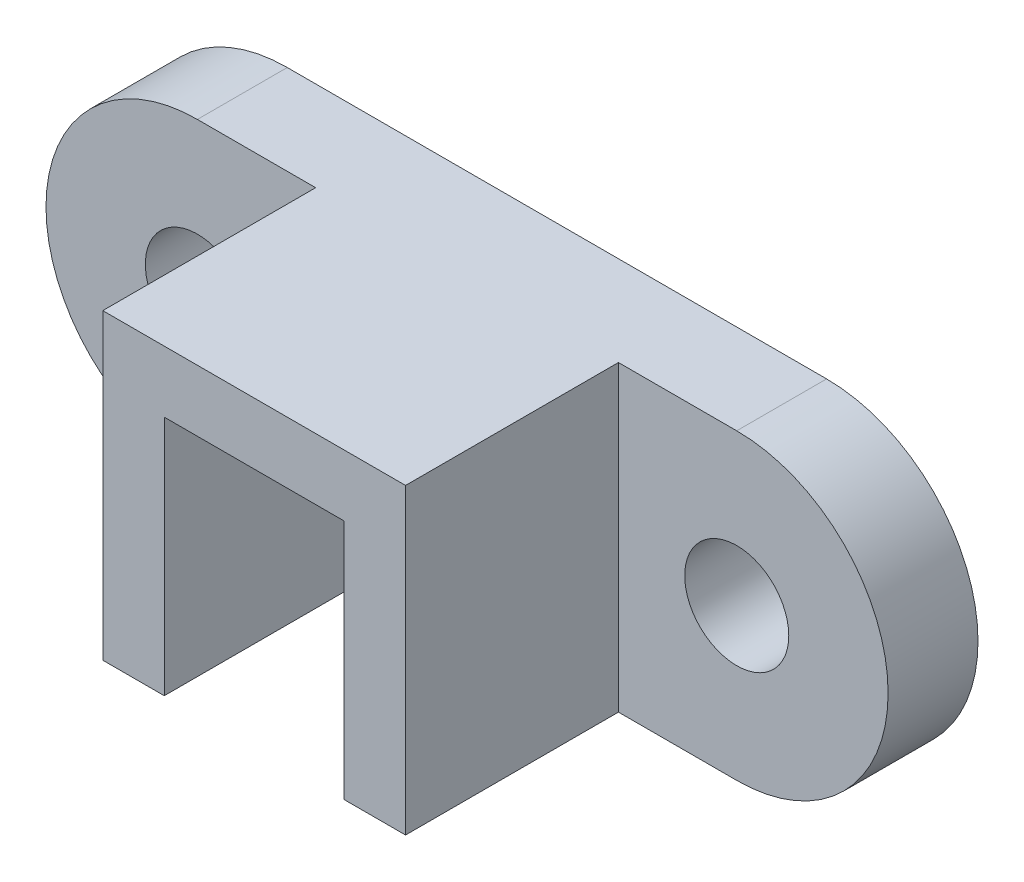
ISO-10303-21;
HEADER;
FILE_DESCRIPTION(('STEP AP214'),'2;1');
FILE_NAME('part.step','',(''),(''),'','','');
FILE_SCHEMA(('AUTOMOTIVE_DESIGN { 1 0 10303 214 1 1 1 1 }'));
ENDSEC;
DATA;
#1=APPLICATION_CONTEXT('core data for automotive mechanical design processes');
#2=APPLICATION_PROTOCOL_DEFINITION('international standard','automotive_design',2000,#1);
#3=PRODUCT_CONTEXT('',#1,'mechanical');
#4=PRODUCT('Part','Part','',(#3));
#5=PRODUCT_RELATED_PRODUCT_CATEGORY('part','',(#4));
#6=PRODUCT_DEFINITION_FORMATION('','',#4);
#7=PRODUCT_DEFINITION_CONTEXT('part definition',#1,'design');
#8=PRODUCT_DEFINITION('design','',#6,#7);
#9=PRODUCT_DEFINITION_SHAPE('','',#8);
#10=(LENGTH_UNIT() NAMED_UNIT(*) SI_UNIT(.MILLI.,.METRE.));
#11=(NAMED_UNIT(*) PLANE_ANGLE_UNIT() SI_UNIT($,.RADIAN.));
#12=(NAMED_UNIT(*) SI_UNIT($,.STERADIAN.) SOLID_ANGLE_UNIT());
#13=UNCERTAINTY_MEASURE_WITH_UNIT(LENGTH_MEASURE(1.E-05),#10,'distance_accuracy_value','');
#14=(GEOMETRIC_REPRESENTATION_CONTEXT(3) GLOBAL_UNCERTAINTY_ASSIGNED_CONTEXT((#13)) GLOBAL_UNIT_ASSIGNED_CONTEXT((#10,
#11,#12)) REPRESENTATION_CONTEXT('',''));
#15=CARTESIAN_POINT('',(0.,0.,0.));
#16=DIRECTION('',(0.,0.,1.));
#17=DIRECTION('',(1.,0.,0.));
#18=AXIS2_PLACEMENT_3D('',#15,#16,#17);
#19=CARTESIAN_POINT('',(-57.,-32.,19.));
#20=DIRECTION('',(0.,1.,0.));
#21=DIRECTION('',(-1.,0.,0.));
#22=AXIS2_PLACEMENT_3D('',#19,#20,#21);
#23=PLANE('',#22);
#24=DIRECTION('',(0.,0.,-1.));
#25=VECTOR('',#24,1.);
#26=CARTESIAN_POINT('',(19.,-32.,13.));
#27=LINE('',#26,#25);
#28=CARTESIAN_POINT('',(19.,-32.,64.));
#29=VERTEX_POINT('',#28);
#30=CARTESIAN_POINT('',(19.,-32.,13.));
#31=VERTEX_POINT('',#30);
#32=EDGE_CURVE('E130',#29,#31,#27,.T.);
#33=ORIENTED_EDGE('',*,*,#32,.T.);
#34=DIRECTION('',(1.,0.,0.));
#35=VECTOR('',#34,1.);
#36=CARTESIAN_POINT('',(-19.,-32.,13.));
#37=LINE('',#36,#35);
#38=CARTESIAN_POINT('',(-19.,-32.,13.));
#39=VERTEX_POINT('',#38);
#40=EDGE_CURVE('E177',#39,#31,#37,.T.);
#41=ORIENTED_EDGE('',*,*,#40,.F.);
#42=DIRECTION('',(0.,0.,-1.));
#43=VECTOR('',#42,1.);
#44=CARTESIAN_POINT('',(-19.,-32.,13.));
#45=LINE('',#44,#43);
#46=CARTESIAN_POINT('',(-19.,-32.,64.));
#47=VERTEX_POINT('',#46);
#48=EDGE_CURVE('E169',#47,#39,#45,.T.);
#49=ORIENTED_EDGE('',*,*,#48,.F.);
#50=DIRECTION('',(1.,0.,0.));
#51=VECTOR('',#50,1.);
#52=CARTESIAN_POINT('',(-32.,-32.,64.));
#53=LINE('',#52,#51);
#54=CARTESIAN_POINT('',(-32.,-32.,64.));
#55=VERTEX_POINT('',#54);
#56=EDGE_CURVE('E189',#55,#47,#53,.T.);
#57=ORIENTED_EDGE('',*,*,#56,.F.);
#58=DIRECTION('',(0.,0.,-1.));
#59=VECTOR('',#58,1.);
#60=CARTESIAN_POINT('',(-32.,-32.,64.));
#61=LINE('',#60,#59);
#62=CARTESIAN_POINT('',(-32.,-32.,19.));
#63=VERTEX_POINT('',#62);
#64=EDGE_CURVE('E193',#55,#63,#61,.T.);
#65=ORIENTED_EDGE('',*,*,#64,.T.);
#66=DIRECTION('',(1.,0.,0.));
#67=VECTOR('',#66,1.);
#68=CARTESIAN_POINT('',(-57.,-32.,19.));
#69=LINE('',#68,#67);
#70=CARTESIAN_POINT('',(-57.,-32.,19.));
#71=VERTEX_POINT('',#70);
#72=EDGE_CURVE('E226',#71,#63,#69,.T.);
#73=ORIENTED_EDGE('',*,*,#72,.F.);
#74=DIRECTION('',(0.,0.,-1.));
#75=VECTOR('',#74,1.);
#76=CARTESIAN_POINT('',(-57.,-32.,19.));
#77=LINE('',#76,#75);
#78=CARTESIAN_POINT('',(-57.,-32.,0.));
#79=VERTEX_POINT('',#78);
#80=EDGE_CURVE('E11',#71,#79,#77,.T.);
#81=ORIENTED_EDGE('',*,*,#80,.T.);
#82=DIRECTION('',(1.,0.,0.));
#83=VECTOR('',#82,1.);
#84=CARTESIAN_POINT('',(-57.,-32.,0.));
#85=LINE('',#84,#83);
#86=CARTESIAN_POINT('',(57.,-32.,0.));
#87=VERTEX_POINT('',#86);
#88=EDGE_CURVE('E241',#79,#87,#85,.T.);
#89=ORIENTED_EDGE('',*,*,#88,.T.);
#90=DIRECTION('',(0.,0.,-1.));
#91=VECTOR('',#90,1.);
#92=CARTESIAN_POINT('',(57.,-32.,19.));
#93=LINE('',#92,#91);
#94=CARTESIAN_POINT('',(57.,-32.,19.));
#95=VERTEX_POINT('',#94);
#96=EDGE_CURVE('E54',#95,#87,#93,.T.);
#97=ORIENTED_EDGE('',*,*,#96,.F.);
#98=CARTESIAN_POINT('',(32.,-32.,19.));
#99=VERTEX_POINT('',#98);
#100=EDGE_CURVE('E224',#99,#95,#69,.T.);
#101=ORIENTED_EDGE('',*,*,#100,.F.);
#102=DIRECTION('',(0.,0.,-1.));
#103=VECTOR('',#102,1.);
#104=CARTESIAN_POINT('',(32.,-32.,64.));
#105=LINE('',#104,#103);
#106=CARTESIAN_POINT('',(32.,-32.,64.));
#107=VERTEX_POINT('',#106);
#108=EDGE_CURVE('E152',#107,#99,#105,.T.);
#109=ORIENTED_EDGE('',*,*,#108,.F.);
#110=DIRECTION('',(-1.,0.,0.));
#111=VECTOR('',#110,1.);
#112=CARTESIAN_POINT('',(32.,-32.,64.));
#113=LINE('',#112,#111);
#114=EDGE_CURVE('E145',#107,#29,#113,.T.);
#115=ORIENTED_EDGE('',*,*,#114,.T.);
#116=EDGE_LOOP('',(#33,#41,#49,#57,#65,#73,#81,#89,#97,#101,#109,#115));
#117=FACE_BOUND('',#116,.T.);
#118=ADVANCED_FACE('F45',(#117),#23,.F.);
#119=CARTESIAN_POINT('',(0.,0.,64.));
#120=DIRECTION('',(0.,0.,1.));
#121=DIRECTION('',(1.,0.,0.));
#122=AXIS2_PLACEMENT_3D('',#119,#120,#121);
#123=PLANE('',#122);
#124=DIRECTION('',(1.,0.,0.));
#125=VECTOR('',#124,1.);
#126=CARTESIAN_POINT('',(-19.,19.,64.));
#127=LINE('',#126,#125);
#128=CARTESIAN_POINT('',(-19.,19.,64.));
#129=VERTEX_POINT('',#128);
#130=CARTESIAN_POINT('',(19.,19.,64.));
#131=VERTEX_POINT('',#130);
#132=EDGE_CURVE('E148',#129,#131,#127,.T.);
#133=ORIENTED_EDGE('',*,*,#132,.T.);
#134=DIRECTION('',(0.,-1.,0.));
#135=VECTOR('',#134,1.);
#136=CARTESIAN_POINT('',(19.,-32.,64.));
#137=LINE('',#136,#135);
#138=EDGE_CURVE('E133',#131,#29,#137,.T.);
#139=ORIENTED_EDGE('',*,*,#138,.T.);
#140=ORIENTED_EDGE('',*,*,#114,.F.);
#141=DIRECTION('',(0.,-1.,0.));
#142=VECTOR('',#141,1.);
#143=CARTESIAN_POINT('',(32.,32.,64.));
#144=LINE('',#143,#142);
#145=CARTESIAN_POINT('',(32.,32.,64.));
#146=VERTEX_POINT('',#145);
#147=EDGE_CURVE('E154',#146,#107,#144,.T.);
#148=ORIENTED_EDGE('',*,*,#147,.F.);
#149=DIRECTION('',(-1.,0.,0.));
#150=VECTOR('',#149,1.);
#151=CARTESIAN_POINT('',(0.,32.,64.));
#152=LINE('',#151,#150);
#153=CARTESIAN_POINT('',(-32.,32.,64.));
#154=VERTEX_POINT('',#153);
#155=EDGE_CURVE('E182',#146,#154,#152,.T.);
#156=ORIENTED_EDGE('',*,*,#155,.T.);
#157=DIRECTION('',(0.,-1.,0.));
#158=VECTOR('',#157,1.);
#159=CARTESIAN_POINT('',(-32.,32.,64.));
#160=LINE('',#159,#158);
#161=EDGE_CURVE('E186',#154,#55,#160,.T.);
#162=ORIENTED_EDGE('',*,*,#161,.T.);
#163=ORIENTED_EDGE('',*,*,#56,.T.);
#164=DIRECTION('',(0.,-1.,0.));
#165=VECTOR('',#164,1.);
#166=CARTESIAN_POINT('',(-19.,-32.,64.));
#167=LINE('',#166,#165);
#168=EDGE_CURVE('E174',#129,#47,#167,.T.);
#169=ORIENTED_EDGE('',*,*,#168,.F.);
#170=EDGE_LOOP('',(#133,#139,#140,#148,#156,#162,#163,#169));
#171=FACE_BOUND('',#170,.T.);
#172=ADVANCED_FACE('F143',(#171),#123,.T.);
#173=CARTESIAN_POINT('',(-57.,0.,19.));
#174=DIRECTION('',(0.,0.,1.));
#175=DIRECTION('',(1.,0.,0.));
#176=AXIS2_PLACEMENT_3D('',#173,#174,#175);
#177=PLANE('',#176);
#178=DIRECTION('',(0.,-1.,0.));
#179=VECTOR('',#178,1.);
#180=CARTESIAN_POINT('',(32.,32.,19.));
#181=LINE('',#180,#179);
#182=CARTESIAN_POINT('',(32.,32.,19.));
#183=VERTEX_POINT('',#182);
#184=EDGE_CURVE('E155',#183,#99,#181,.T.);
#185=ORIENTED_EDGE('',*,*,#184,.T.);
#186=ORIENTED_EDGE('',*,*,#100,.T.);
#187=CARTESIAN_POINT('',(57.,0.,19.));
#188=DIRECTION('',(0.,0.,1.));
#189=DIRECTION('',(1.,0.,0.));
#190=AXIS2_PLACEMENT_3D('',#187,#188,#189);
#191=CIRCLE('',#190,32.);
#192=CARTESIAN_POINT('',(57.,32.,19.));
#193=VERTEX_POINT('',#192);
#194=EDGE_CURVE('E229',#95,#193,#191,.T.);
#195=ORIENTED_EDGE('',*,*,#194,.T.);
#196=DIRECTION('',(-1.,0.,0.));
#197=VECTOR('',#196,1.);
#198=CARTESIAN_POINT('',(-57.,32.,19.));
#199=LINE('',#198,#197);
#200=EDGE_CURVE('E233',#193,#183,#199,.T.);
#201=ORIENTED_EDGE('',*,*,#200,.T.);
#202=EDGE_LOOP('',(#185,#186,#195,#201));
#203=FACE_BOUND('',#202,.T.);
#204=CARTESIAN_POINT('',(57.,0.,19.));
#205=DIRECTION('',(0.,0.,1.));
#206=DIRECTION('',(1.,0.,0.));
#207=AXIS2_PLACEMENT_3D('',#204,#205,#206);
#208=CIRCLE('',#207,11.);
#209=CARTESIAN_POINT('',(67.9999999999999,0.,19.));
#210=VERTEX_POINT('',#209);
#211=EDGE_CURVE('E213',#210,#210,#208,.T.);
#212=ORIENTED_EDGE('',*,*,#211,.F.);
#213=EDGE_LOOP('',(#212));
#214=FACE_BOUND('',#213,.T.);
#215=ADVANCED_FACE('F280',(#203,#214),#177,.T.);
#216=CARTESIAN_POINT('',(-57.,0.,19.));
#217=DIRECTION('',(0.,0.,-1.));
#218=DIRECTION('',(-1.,0.,0.));
#219=AXIS2_PLACEMENT_3D('',#216,#217,#218);
#220=CYLINDRICAL_SURFACE('',#219,32.);
#221=CARTESIAN_POINT('',(-57.,0.,0.));
#222=DIRECTION('',(0.,0.,1.));
#223=DIRECTION('',(1.,0.,0.));
#224=AXIS2_PLACEMENT_3D('',#221,#222,#223);
#225=CIRCLE('',#224,32.);
#226=CARTESIAN_POINT('',(-57.,32.,0.));
#227=VERTEX_POINT('',#226);
#228=EDGE_CURVE('E208',#227,#79,#225,.T.);
#229=ORIENTED_EDGE('',*,*,#228,.T.);
#230=ORIENTED_EDGE('',*,*,#80,.F.);
#231=CARTESIAN_POINT('',(-57.,0.,19.));
#232=DIRECTION('',(0.,0.,1.));
#233=DIRECTION('',(1.,0.,0.));
#234=AXIS2_PLACEMENT_3D('',#231,#232,#233);
#235=CIRCLE('',#234,32.);
#236=CARTESIAN_POINT('',(-57.,32.,19.));
#237=VERTEX_POINT('',#236);
#238=EDGE_CURVE('E220',#237,#71,#235,.T.);
#239=ORIENTED_EDGE('',*,*,#238,.F.);
#240=DIRECTION('',(0.,0.,-1.));
#241=VECTOR('',#240,1.);
#242=CARTESIAN_POINT('',(-57.,32.,19.));
#243=LINE('',#242,#241);
#244=EDGE_CURVE('E237',#237,#227,#243,.T.);
#245=ORIENTED_EDGE('',*,*,#244,.T.);
#246=EDGE_LOOP('',(#229,#230,#239,#245));
#247=FACE_BOUND('',#246,.T.);
#248=ADVANCED_FACE('F47',(#247),#220,.T.);
#249=CARTESIAN_POINT('',(57.,0.,19.));
#250=DIRECTION('',(0.,0.,-1.));
#251=DIRECTION('',(-1.,0.,0.));
#252=AXIS2_PLACEMENT_3D('',#249,#250,#251);
#253=CYLINDRICAL_SURFACE('',#252,32.);
#254=CARTESIAN_POINT('',(57.,0.,0.));
#255=DIRECTION('',(0.,0.,1.));
#256=DIRECTION('',(1.,0.,0.));
#257=AXIS2_PLACEMENT_3D('',#254,#255,#256);
#258=CIRCLE('',#257,32.);
#259=CARTESIAN_POINT('',(57.,32.,0.));
#260=VERTEX_POINT('',#259);
#261=EDGE_CURVE('E244',#87,#260,#258,.T.);
#262=ORIENTED_EDGE('',*,*,#261,.T.);
#263=DIRECTION('',(0.,0.,-1.));
#264=VECTOR('',#263,1.);
#265=CARTESIAN_POINT('',(57.,32.,19.));
#266=LINE('',#265,#264);
#267=EDGE_CURVE('E252',#193,#260,#266,.T.);
#268=ORIENTED_EDGE('',*,*,#267,.F.);
#269=ORIENTED_EDGE('',*,*,#194,.F.);
#270=ORIENTED_EDGE('',*,*,#96,.T.);
#271=EDGE_LOOP('',(#262,#268,#269,#270));
#272=FACE_BOUND('',#271,.T.);
#273=ADVANCED_FACE('F261',(#272),#253,.T.);
#274=CARTESIAN_POINT('',(-57.,32.,19.));
#275=DIRECTION('',(0.,-1.,0.));
#276=DIRECTION('',(1.,0.,0.));
#277=AXIS2_PLACEMENT_3D('',#274,#275,#276);
#278=PLANE('',#277);
#279=DIRECTION('',(0.,0.,-1.));
#280=VECTOR('',#279,1.);
#281=CARTESIAN_POINT('',(32.,32.,64.));
#282=LINE('',#281,#280);
#283=EDGE_CURVE('E159',#146,#183,#282,.T.);
#284=ORIENTED_EDGE('',*,*,#283,.T.);
#285=ORIENTED_EDGE('',*,*,#200,.F.);
#286=ORIENTED_EDGE('',*,*,#267,.T.);
#287=DIRECTION('',(-1.,0.,0.));
#288=VECTOR('',#287,1.);
#289=CARTESIAN_POINT('',(-57.,32.,0.));
#290=LINE('',#289,#288);
#291=EDGE_CURVE('E225',#260,#227,#290,.T.);
#292=ORIENTED_EDGE('',*,*,#291,.T.);
#293=ORIENTED_EDGE('',*,*,#244,.F.);
#294=CARTESIAN_POINT('',(-32.,32.,19.));
#295=VERTEX_POINT('',#294);
#296=EDGE_CURVE('E232',#295,#237,#199,.T.);
#297=ORIENTED_EDGE('',*,*,#296,.F.);
#298=DIRECTION('',(0.,0.,-1.));
#299=VECTOR('',#298,1.);
#300=CARTESIAN_POINT('',(-32.,32.,64.));
#301=LINE('',#300,#299);
#302=EDGE_CURVE('E199',#154,#295,#301,.T.);
#303=ORIENTED_EDGE('',*,*,#302,.F.);
#304=ORIENTED_EDGE('',*,*,#155,.F.);
#305=EDGE_LOOP('',(#284,#285,#286,#292,#293,#297,#303,#304));
#306=FACE_BOUND('',#305,.T.);
#307=ADVANCED_FACE('F269',(#306),#278,.F.);
#308=DIRECTION('',(0.,-1.,0.));
#309=VECTOR('',#308,1.);
#310=CARTESIAN_POINT('',(-32.,32.,19.));
#311=LINE('',#310,#309);
#312=EDGE_CURVE('E69',#295,#63,#311,.T.);
#313=ORIENTED_EDGE('',*,*,#312,.F.);
#314=ORIENTED_EDGE('',*,*,#296,.T.);
#315=ORIENTED_EDGE('',*,*,#238,.T.);
#316=ORIENTED_EDGE('',*,*,#72,.T.);
#317=EDGE_LOOP('',(#313,#314,#315,#316));
#318=FACE_BOUND('',#317,.T.);
#319=CARTESIAN_POINT('',(-57.,0.,19.));
#320=DIRECTION('',(0.,0.,1.));
#321=DIRECTION('',(1.,0.,0.));
#322=AXIS2_PLACEMENT_3D('',#319,#320,#321);
#323=CIRCLE('',#322,11.);
#324=CARTESIAN_POINT('',(-46.,0.,19.));
#325=VERTEX_POINT('',#324);
#326=EDGE_CURVE('E209',#325,#325,#323,.T.);
#327=ORIENTED_EDGE('',*,*,#326,.F.);
#328=EDGE_LOOP('',(#327));
#329=FACE_BOUND('',#328,.T.);
#330=ADVANCED_FACE('F274',(#318,#329),#177,.T.);
#331=CARTESIAN_POINT('',(-57.,0.,0.));
#332=DIRECTION('',(0.,0.,1.));
#333=DIRECTION('',(1.,0.,0.));
#334=AXIS2_PLACEMENT_3D('',#331,#332,#333);
#335=PLANE('',#334);
#336=CARTESIAN_POINT('',(-57.,0.,0.));
#337=DIRECTION('',(0.,0.,1.));
#338=DIRECTION('',(1.,0.,0.));
#339=AXIS2_PLACEMENT_3D('',#336,#337,#338);
#340=CIRCLE('',#339,11.);
#341=CARTESIAN_POINT('',(-46.,0.,0.));
#342=VERTEX_POINT('',#341);
#343=EDGE_CURVE('E204',#342,#342,#340,.T.);
#344=ORIENTED_EDGE('',*,*,#343,.T.);
#345=EDGE_LOOP('',(#344));
#346=FACE_BOUND('',#345,.T.);
#347=CARTESIAN_POINT('',(57.,0.,0.));
#348=DIRECTION('',(0.,0.,1.));
#349=DIRECTION('',(1.,0.,0.));
#350=AXIS2_PLACEMENT_3D('',#347,#348,#349);
#351=CIRCLE('',#350,11.);
#352=CARTESIAN_POINT('',(67.9999999999999,0.,0.));
#353=VERTEX_POINT('',#352);
#354=EDGE_CURVE('E203',#353,#353,#351,.T.);
#355=ORIENTED_EDGE('',*,*,#354,.T.);
#356=EDGE_LOOP('',(#355));
#357=FACE_BOUND('',#356,.T.);
#358=ORIENTED_EDGE('',*,*,#228,.F.);
#359=ORIENTED_EDGE('',*,*,#291,.F.);
#360=ORIENTED_EDGE('',*,*,#261,.F.);
#361=ORIENTED_EDGE('',*,*,#88,.F.);
#362=EDGE_LOOP('',(#358,#359,#360,#361));
#363=FACE_BOUND('',#362,.T.);
#364=ADVANCED_FACE('F266',(#346,#357,#363),#335,.F.);
#365=CARTESIAN_POINT('',(57.,0.,0.));
#366=DIRECTION('',(0.,0.,1.));
#367=DIRECTION('',(1.,0.,0.));
#368=AXIS2_PLACEMENT_3D('',#365,#366,#367);
#369=CYLINDRICAL_SURFACE('',#368,11.);
#370=ORIENTED_EDGE('',*,*,#354,.F.);
#371=EDGE_LOOP('',(#370));
#372=FACE_BOUND('',#371,.T.);
#373=ORIENTED_EDGE('',*,*,#211,.T.);
#374=EDGE_LOOP('',(#373));
#375=FACE_BOUND('',#374,.T.);
#376=ADVANCED_FACE('F317',(#372,#375),#369,.F.);
#377=CARTESIAN_POINT('',(-57.,0.,0.));
#378=DIRECTION('',(0.,0.,1.));
#379=DIRECTION('',(1.,0.,0.));
#380=AXIS2_PLACEMENT_3D('',#377,#378,#379);
#381=CYLINDRICAL_SURFACE('',#380,11.);
#382=ORIENTED_EDGE('',*,*,#343,.F.);
#383=EDGE_LOOP('',(#382));
#384=FACE_BOUND('',#383,.T.);
#385=ORIENTED_EDGE('',*,*,#326,.T.);
#386=EDGE_LOOP('',(#385));
#387=FACE_BOUND('',#386,.T.);
#388=ADVANCED_FACE('F304',(#384,#387),#381,.F.);
#389=CARTESIAN_POINT('',(-32.,32.,64.));
#390=DIRECTION('',(1.,0.,0.));
#391=DIRECTION('',(0.,1.,0.));
#392=AXIS2_PLACEMENT_3D('',#389,#390,#391);
#393=PLANE('',#392);
#394=ORIENTED_EDGE('',*,*,#312,.T.);
#395=ORIENTED_EDGE('',*,*,#64,.F.);
#396=ORIENTED_EDGE('',*,*,#161,.F.);
#397=ORIENTED_EDGE('',*,*,#302,.T.);
#398=EDGE_LOOP('',(#394,#395,#396,#397));
#399=FACE_BOUND('',#398,.T.);
#400=ADVANCED_FACE('F288',(#399),#393,.F.);
#401=CARTESIAN_POINT('',(-19.,-32.,13.));
#402=DIRECTION('',(0.,0.707106781186547,-0.707106781186548));
#403=DIRECTION('',(0.,0.707106781186548,0.707106781186547));
#404=AXIS2_PLACEMENT_3D('',#401,#402,#403);
#405=PLANE('',#404);
#406=ORIENTED_EDGE('',*,*,#40,.T.);
#407=DIRECTION('',(0.,0.707106781186548,0.707106781186547));
#408=VECTOR('',#407,1.);
#409=CARTESIAN_POINT('',(19.,-32.,13.));
#410=LINE('',#409,#408);
#411=EDGE_CURVE('E135',#31,#131,#410,.T.);
#412=ORIENTED_EDGE('',*,*,#411,.T.);
#413=ORIENTED_EDGE('',*,*,#132,.F.);
#414=DIRECTION('',(0.,0.707106781186548,0.707106781186547));
#415=VECTOR('',#414,1.);
#416=CARTESIAN_POINT('',(-19.,-32.,13.));
#417=LINE('',#416,#415);
#418=EDGE_CURVE('E61',#39,#129,#417,.T.);
#419=ORIENTED_EDGE('',*,*,#418,.F.);
#420=EDGE_LOOP('',(#406,#412,#413,#419));
#421=FACE_BOUND('',#420,.T.);
#422=ADVANCED_FACE('F293',(#421),#405,.F.);
#423=CARTESIAN_POINT('',(-19.,0.,0.));
#424=DIRECTION('',(-1.,0.,0.));
#425=DIRECTION('',(0.,0.,1.));
#426=AXIS2_PLACEMENT_3D('',#423,#424,#425);
#427=PLANE('',#426);
#428=ORIENTED_EDGE('',*,*,#48,.T.);
#429=ORIENTED_EDGE('',*,*,#418,.T.);
#430=ORIENTED_EDGE('',*,*,#168,.T.);
#431=EDGE_LOOP('',(#428,#429,#430));
#432=FACE_BOUND('',#431,.T.);
#433=ADVANCED_FACE('F291',(#432),#427,.F.);
#434=CARTESIAN_POINT('',(32.,32.,64.));
#435=DIRECTION('',(1.,0.,0.));
#436=DIRECTION('',(0.,1.,0.));
#437=AXIS2_PLACEMENT_3D('',#434,#435,#436);
#438=PLANE('',#437);
#439=ORIENTED_EDGE('',*,*,#184,.F.);
#440=ORIENTED_EDGE('',*,*,#283,.F.);
#441=ORIENTED_EDGE('',*,*,#147,.T.);
#442=ORIENTED_EDGE('',*,*,#108,.T.);
#443=EDGE_LOOP('',(#439,#440,#441,#442));
#444=FACE_BOUND('',#443,.T.);
#445=ADVANCED_FACE('F285',(#444),#438,.T.);
#446=CARTESIAN_POINT('',(19.,0.,0.));
#447=DIRECTION('',(1.,0.,0.));
#448=DIRECTION('',(0.,0.,1.));
#449=AXIS2_PLACEMENT_3D('',#446,#447,#448);
#450=PLANE('',#449);
#451=ORIENTED_EDGE('',*,*,#32,.F.);
#452=ORIENTED_EDGE('',*,*,#138,.F.);
#453=ORIENTED_EDGE('',*,*,#411,.F.);
#454=EDGE_LOOP('',(#451,#452,#453));
#455=FACE_BOUND('',#454,.T.);
#456=ADVANCED_FACE('F132',(#455),#450,.F.);
#457=CLOSED_SHELL('',(#118,#172,#215,#248,#273,#307,#330,#364,#376,#388,#400,#422,#433,#445,#456));
#458=MANIFOLD_SOLID_BREP('B2',#457);
#459=ADVANCED_BREP_SHAPE_REPRESENTATION('',(#18,#458),#14);
#460=SHAPE_DEFINITION_REPRESENTATION(#9,#459);
ENDSEC;
END-ISO-10303-21;
